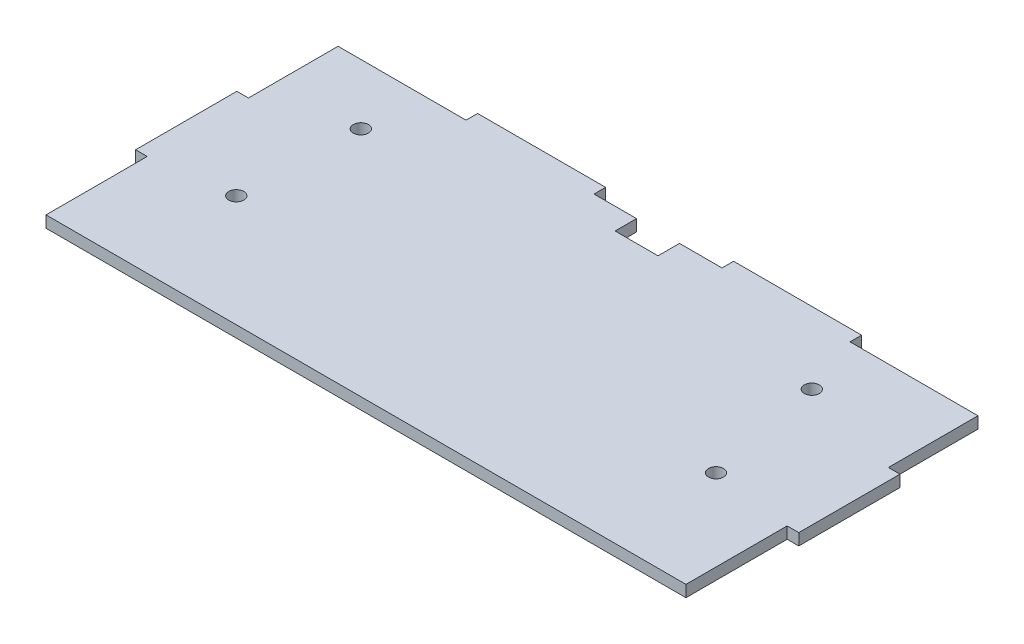
ISO-10303-21;
HEADER;
FILE_DESCRIPTION(('STEP AP214'),'2;1');
FILE_NAME('part.step','',(''),(''),'','','');
FILE_SCHEMA(('AUTOMOTIVE_DESIGN { 1 0 10303 214 1 1 1 1 }'));
ENDSEC;
DATA;
#1=APPLICATION_CONTEXT('core data for automotive mechanical design processes');
#2=APPLICATION_PROTOCOL_DEFINITION('international standard','automotive_design',2000,#1);
#3=PRODUCT_CONTEXT('',#1,'mechanical');
#4=PRODUCT('Part','Part','',(#3));
#5=PRODUCT_RELATED_PRODUCT_CATEGORY('part','',(#4));
#6=PRODUCT_DEFINITION_FORMATION('','',#4);
#7=PRODUCT_DEFINITION_CONTEXT('part definition',#1,'design');
#8=PRODUCT_DEFINITION('design','',#6,#7);
#9=PRODUCT_DEFINITION_SHAPE('','',#8);
#10=(LENGTH_UNIT() NAMED_UNIT(*) SI_UNIT(.MILLI.,.METRE.));
#11=(NAMED_UNIT(*) PLANE_ANGLE_UNIT() SI_UNIT($,.RADIAN.));
#12=(NAMED_UNIT(*) SI_UNIT($,.STERADIAN.) SOLID_ANGLE_UNIT());
#13=UNCERTAINTY_MEASURE_WITH_UNIT(LENGTH_MEASURE(1.E-05),#10,'distance_accuracy_value','');
#14=(GEOMETRIC_REPRESENTATION_CONTEXT(3) GLOBAL_UNCERTAINTY_ASSIGNED_CONTEXT((#13)) GLOBAL_UNIT_ASSIGNED_CONTEXT((#10,
#11,#12)) REPRESENTATION_CONTEXT('',''));
#15=CARTESIAN_POINT('',(0.,0.,0.));
#16=DIRECTION('',(0.,0.,1.));
#17=DIRECTION('',(1.,0.,0.));
#18=AXIS2_PLACEMENT_3D('',#15,#16,#17);
#19=CARTESIAN_POINT('',(0.,2.7,0.));
#20=DIRECTION('',(0.,-1.,0.));
#21=DIRECTION('',(0.,0.,-1.));
#22=AXIS2_PLACEMENT_3D('',#19,#20,#21);
#23=PLANE('',#22);
#24=DIRECTION('',(1.,0.,0.));
#25=VECTOR('',#24,1.);
#26=CARTESIAN_POINT('',(-7.69999999999999,2.7,-18.5666666666667));
#27=LINE('',#26,#25);
#28=CARTESIAN_POINT('',(-7.69999999999999,2.7,-18.5666666666667));
#29=VERTEX_POINT('',#28);
#30=CARTESIAN_POINT('',(-5.,2.7,-18.5666666666667));
#31=VERTEX_POINT('',#30);
#32=EDGE_CURVE('E273',#29,#31,#27,.T.);
#33=ORIENTED_EDGE('',*,*,#32,.T.);
#34=DIRECTION('',(0.,0.,1.));
#35=VECTOR('',#34,1.);
#36=CARTESIAN_POINT('',(-5.,2.7,-18.5666666666667));
#37=LINE('',#36,#35);
#38=CARTESIAN_POINT('',(-5.,2.7,5.));
#39=VERTEX_POINT('',#38);
#40=EDGE_CURVE('E140',#31,#39,#37,.T.);
#41=ORIENTED_EDGE('',*,*,#40,.T.);
#42=DIRECTION('',(1.,0.,0.));
#43=VECTOR('',#42,1.);
#44=CARTESIAN_POINT('',(-5.,2.7,5.));
#45=LINE('',#44,#43);
#46=CARTESIAN_POINT('',(144.,2.7,5.));
#47=VERTEX_POINT('',#46);
#48=EDGE_CURVE('E335',#39,#47,#45,.T.);
#49=ORIENTED_EDGE('',*,*,#48,.T.);
#50=DIRECTION('',(0.,0.,-1.));
#51=VECTOR('',#50,1.);
#52=CARTESIAN_POINT('',(144.,2.7,-18.5666666666667));
#53=LINE('',#52,#51);
#54=CARTESIAN_POINT('',(144.,2.7,-18.5666666666667));
#55=VERTEX_POINT('',#54);
#56=EDGE_CURVE('E356',#47,#55,#53,.T.);
#57=ORIENTED_EDGE('',*,*,#56,.T.);
#58=DIRECTION('',(1.,0.,0.));
#59=VECTOR('',#58,1.);
#60=CARTESIAN_POINT('',(146.7,2.7,-18.5666666666667));
#61=LINE('',#60,#59);
#62=CARTESIAN_POINT('',(146.7,2.7,-18.5666666666667));
#63=VERTEX_POINT('',#62);
#64=EDGE_CURVE('E353',#55,#63,#61,.T.);
#65=ORIENTED_EDGE('',*,*,#64,.T.);
#66=DIRECTION('',(0.,0.,-1.));
#67=VECTOR('',#66,1.);
#68=CARTESIAN_POINT('',(146.7,2.7,-18.5666666666667));
#69=LINE('',#68,#67);
#70=CARTESIAN_POINT('',(146.7,2.7,-42.1333333333333));
#71=VERTEX_POINT('',#70);
#72=EDGE_CURVE('E355',#63,#71,#69,.T.);
#73=ORIENTED_EDGE('',*,*,#72,.T.);
#74=DIRECTION('',(-1.,0.,0.));
#75=VECTOR('',#74,1.);
#76=CARTESIAN_POINT('',(146.7,2.7,-42.1333333333333));
#77=LINE('',#76,#75);
#78=CARTESIAN_POINT('',(144.,2.7,-42.1333333333333));
#79=VERTEX_POINT('',#78);
#80=EDGE_CURVE('E358',#71,#79,#77,.T.);
#81=ORIENTED_EDGE('',*,*,#80,.T.);
#82=DIRECTION('',(0.,0.,-1.));
#83=VECTOR('',#82,1.);
#84=CARTESIAN_POINT('',(144.,2.7,-63.));
#85=LINE('',#84,#83);
#86=CARTESIAN_POINT('',(144.,2.7,-63.));
#87=VERTEX_POINT('',#86);
#88=EDGE_CURVE('E364',#79,#87,#85,.T.);
#89=ORIENTED_EDGE('',*,*,#88,.T.);
#90=DIRECTION('',(-1.,0.,0.));
#91=VECTOR('',#90,1.);
#92=CARTESIAN_POINT('',(114.2,2.7,-63.));
#93=LINE('',#92,#91);
#94=CARTESIAN_POINT('',(114.2,2.7,-63.));
#95=VERTEX_POINT('',#94);
#96=EDGE_CURVE('E366',#87,#95,#93,.T.);
#97=ORIENTED_EDGE('',*,*,#96,.T.);
#98=DIRECTION('',(0.,0.,-1.));
#99=VECTOR('',#98,1.);
#100=CARTESIAN_POINT('',(114.2,2.7,-65.7));
#101=LINE('',#100,#99);
#102=CARTESIAN_POINT('',(114.2,2.7,-65.7));
#103=VERTEX_POINT('',#102);
#104=EDGE_CURVE('E368',#95,#103,#101,.T.);
#105=ORIENTED_EDGE('',*,*,#104,.T.);
#106=DIRECTION('',(-1.,0.,0.));
#107=VECTOR('',#106,1.);
#108=CARTESIAN_POINT('',(84.4,2.7,-65.7));
#109=LINE('',#108,#107);
#110=CARTESIAN_POINT('',(84.4,2.7,-65.7));
#111=VERTEX_POINT('',#110);
#112=EDGE_CURVE('E370',#103,#111,#109,.T.);
#113=ORIENTED_EDGE('',*,*,#112,.T.);
#114=DIRECTION('',(0.,0.,1.));
#115=VECTOR('',#114,1.);
#116=CARTESIAN_POINT('',(84.4,2.7,-65.7));
#117=LINE('',#116,#115);
#118=CARTESIAN_POINT('',(84.4,2.7,-63.));
#119=VERTEX_POINT('',#118);
#120=EDGE_CURVE('E372',#111,#119,#117,.T.);
#121=ORIENTED_EDGE('',*,*,#120,.T.);
#122=DIRECTION('',(-1.,0.,0.));
#123=VECTOR('',#122,1.);
#124=CARTESIAN_POINT('',(74.5,2.7,-63.));
#125=LINE('',#124,#123);
#126=CARTESIAN_POINT('',(74.5,2.7,-63.));
#127=VERTEX_POINT('',#126);
#128=EDGE_CURVE('E374',#119,#127,#125,.T.);
#129=ORIENTED_EDGE('',*,*,#128,.T.);
#130=DIRECTION('',(0.,0.,1.));
#131=VECTOR('',#130,1.);
#132=CARTESIAN_POINT('',(74.5,2.7,-63.));
#133=LINE('',#132,#131);
#134=CARTESIAN_POINT('',(74.5,2.7,-58.));
#135=VERTEX_POINT('',#134);
#136=EDGE_CURVE('E376',#127,#135,#133,.T.);
#137=ORIENTED_EDGE('',*,*,#136,.T.);
#138=DIRECTION('',(-1.,0.,0.));
#139=VECTOR('',#138,1.);
#140=CARTESIAN_POINT('',(74.5,2.7,-58.));
#141=LINE('',#140,#139);
#142=CARTESIAN_POINT('',(64.5,2.7,-58.));
#143=VERTEX_POINT('',#142);
#144=EDGE_CURVE('E378',#135,#143,#141,.T.);
#145=ORIENTED_EDGE('',*,*,#144,.T.);
#146=DIRECTION('',(0.,0.,-1.));
#147=VECTOR('',#146,1.);
#148=CARTESIAN_POINT('',(64.5,2.7,-63.));
#149=LINE('',#148,#147);
#150=CARTESIAN_POINT('',(64.5,2.7,-63.));
#151=VERTEX_POINT('',#150);
#152=EDGE_CURVE('E380',#143,#151,#149,.T.);
#153=ORIENTED_EDGE('',*,*,#152,.T.);
#154=DIRECTION('',(-1.,0.,0.));
#155=VECTOR('',#154,1.);
#156=CARTESIAN_POINT('',(54.6,2.7,-63.));
#157=LINE('',#156,#155);
#158=CARTESIAN_POINT('',(54.6,2.7,-63.));
#159=VERTEX_POINT('',#158);
#160=EDGE_CURVE('E382',#151,#159,#157,.T.);
#161=ORIENTED_EDGE('',*,*,#160,.T.);
#162=DIRECTION('',(0.,0.,-1.));
#163=VECTOR('',#162,1.);
#164=CARTESIAN_POINT('',(54.6,2.7,-65.7));
#165=LINE('',#164,#163);
#166=CARTESIAN_POINT('',(54.6,2.7,-65.7));
#167=VERTEX_POINT('',#166);
#168=EDGE_CURVE('E384',#159,#167,#165,.T.);
#169=ORIENTED_EDGE('',*,*,#168,.T.);
#170=DIRECTION('',(-1.,0.,0.));
#171=VECTOR('',#170,1.);
#172=CARTESIAN_POINT('',(24.8,2.7,-65.7));
#173=LINE('',#172,#171);
#174=CARTESIAN_POINT('',(24.8,2.7,-65.7));
#175=VERTEX_POINT('',#174);
#176=EDGE_CURVE('E386',#167,#175,#173,.T.);
#177=ORIENTED_EDGE('',*,*,#176,.T.);
#178=DIRECTION('',(0.,0.,1.));
#179=VECTOR('',#178,1.);
#180=CARTESIAN_POINT('',(24.8,2.7,-65.7));
#181=LINE('',#180,#179);
#182=CARTESIAN_POINT('',(24.8,2.7,-63.));
#183=VERTEX_POINT('',#182);
#184=EDGE_CURVE('E388',#175,#183,#181,.T.);
#185=ORIENTED_EDGE('',*,*,#184,.T.);
#186=DIRECTION('',(-1.,0.,0.));
#187=VECTOR('',#186,1.);
#188=CARTESIAN_POINT('',(-5.,2.7,-63.));
#189=LINE('',#188,#187);
#190=CARTESIAN_POINT('',(-5.,2.7,-63.));
#191=VERTEX_POINT('',#190);
#192=EDGE_CURVE('E207',#183,#191,#189,.T.);
#193=ORIENTED_EDGE('',*,*,#192,.T.);
#194=DIRECTION('',(0.,0.,1.));
#195=VECTOR('',#194,1.);
#196=CARTESIAN_POINT('',(-5.,2.7,-63.));
#197=LINE('',#196,#195);
#198=CARTESIAN_POINT('',(-5.,2.7,-42.1333333333333));
#199=VERTEX_POINT('',#198);
#200=EDGE_CURVE('E201',#191,#199,#197,.T.);
#201=ORIENTED_EDGE('',*,*,#200,.T.);
#202=DIRECTION('',(-1.,0.,0.));
#203=VECTOR('',#202,1.);
#204=CARTESIAN_POINT('',(-7.69999999999999,2.7,-42.1333333333333));
#205=LINE('',#204,#203);
#206=CARTESIAN_POINT('',(-7.69999999999999,2.7,-42.1333333333333));
#207=VERTEX_POINT('',#206);
#208=EDGE_CURVE('E205',#199,#207,#205,.T.);
#209=ORIENTED_EDGE('',*,*,#208,.T.);
#210=DIRECTION('',(0.,0.,1.));
#211=VECTOR('',#210,1.);
#212=CARTESIAN_POINT('',(-7.69999999999999,2.7,-18.5666666666667));
#213=LINE('',#212,#211);
#214=EDGE_CURVE('E49',#207,#29,#213,.T.);
#215=ORIENTED_EDGE('',*,*,#214,.T.);
#216=EDGE_LOOP('',(#33,#41,#49,#57,#65,#73,#81,#89,#97,#105,#113,#121,#129,#137,#145,#153,#161,
#169,#177,#185,#193,#201,#209,#215));
#217=FACE_BOUND('',#216,.T.);
#218=CARTESIAN_POINT('',(13.3,2.7,-21.));
#219=DIRECTION('',(0.,1.,0.));
#220=DIRECTION('',(0.,0.,1.));
#221=AXIS2_PLACEMENT_3D('',#218,#219,#220);
#222=CIRCLE('',#221,1.75);
#223=CARTESIAN_POINT('',(13.3,2.7,-19.25));
#224=VERTEX_POINT('',#223);
#225=EDGE_CURVE('E229',#224,#224,#222,.T.);
#226=ORIENTED_EDGE('',*,*,#225,.F.);
#227=EDGE_LOOP('',(#226));
#228=FACE_BOUND('',#227,.T.);
#229=CARTESIAN_POINT('',(14.3,2.7,-49.));
#230=DIRECTION('',(0.,1.,0.));
#231=DIRECTION('',(0.,0.,1.));
#232=AXIS2_PLACEMENT_3D('',#229,#230,#231);
#233=CIRCLE('',#232,1.75);
#234=CARTESIAN_POINT('',(14.3,2.7,-47.25));
#235=VERTEX_POINT('',#234);
#236=EDGE_CURVE('E724',#235,#235,#233,.T.);
#237=ORIENTED_EDGE('',*,*,#236,.F.);
#238=EDGE_LOOP('',(#237));
#239=FACE_BOUND('',#238,.T.);
#240=CARTESIAN_POINT('',(119.3,2.7,-49.));
#241=DIRECTION('',(0.,1.,0.));
#242=DIRECTION('',(0.,0.,1.));
#243=AXIS2_PLACEMENT_3D('',#240,#241,#242);
#244=CIRCLE('',#243,1.75);
#245=CARTESIAN_POINT('',(119.3,2.7,-47.25));
#246=VERTEX_POINT('',#245);
#247=EDGE_CURVE('E730',#246,#246,#244,.T.);
#248=ORIENTED_EDGE('',*,*,#247,.F.);
#249=EDGE_LOOP('',(#248));
#250=FACE_BOUND('',#249,.T.);
#251=CARTESIAN_POINT('',(125.,2.7,-21.));
#252=DIRECTION('',(0.,1.,0.));
#253=DIRECTION('',(0.,0.,1.));
#254=AXIS2_PLACEMENT_3D('',#251,#252,#253);
#255=CIRCLE('',#254,1.75000000000001);
#256=CARTESIAN_POINT('',(125.,2.7,-19.25));
#257=VERTEX_POINT('',#256);
#258=EDGE_CURVE('E736',#257,#257,#255,.T.);
#259=ORIENTED_EDGE('',*,*,#258,.F.);
#260=EDGE_LOOP('',(#259));
#261=FACE_BOUND('',#260,.T.);
#262=ADVANCED_FACE('F32',(#217,#228,#239,#250,#261),#23,.F.);
#263=CARTESIAN_POINT('',(0.,0.,0.));
#264=DIRECTION('',(0.,-1.,0.));
#265=DIRECTION('',(0.,0.,-1.));
#266=AXIS2_PLACEMENT_3D('',#263,#264,#265);
#267=PLANE('',#266);
#268=CARTESIAN_POINT('',(119.3,0.,-49.));
#269=DIRECTION('',(0.,1.,0.));
#270=DIRECTION('',(0.,0.,1.));
#271=AXIS2_PLACEMENT_3D('',#268,#269,#270);
#272=CIRCLE('',#271,1.75);
#273=CARTESIAN_POINT('',(119.3,0.,-47.25));
#274=VERTEX_POINT('',#273);
#275=EDGE_CURVE('E733',#274,#274,#272,.T.);
#276=ORIENTED_EDGE('',*,*,#275,.T.);
#277=EDGE_LOOP('',(#276));
#278=FACE_BOUND('',#277,.T.);
#279=CARTESIAN_POINT('',(13.3,0.,-21.));
#280=DIRECTION('',(0.,1.,0.));
#281=DIRECTION('',(0.,0.,1.));
#282=AXIS2_PLACEMENT_3D('',#279,#280,#281);
#283=CIRCLE('',#282,1.75);
#284=CARTESIAN_POINT('',(13.3,0.,-19.25));
#285=VERTEX_POINT('',#284);
#286=EDGE_CURVE('E721',#285,#285,#283,.T.);
#287=ORIENTED_EDGE('',*,*,#286,.T.);
#288=EDGE_LOOP('',(#287));
#289=FACE_BOUND('',#288,.T.);
#290=DIRECTION('',(1.,0.,0.));
#291=VECTOR('',#290,1.);
#292=CARTESIAN_POINT('',(-7.69999999999999,0.,-18.5666666666667));
#293=LINE('',#292,#291);
#294=CARTESIAN_POINT('',(-7.69999999999999,0.,-18.5666666666667));
#295=VERTEX_POINT('',#294);
#296=CARTESIAN_POINT('',(-5.,0.,-18.5666666666667));
#297=VERTEX_POINT('',#296);
#298=EDGE_CURVE('E225',#295,#297,#293,.T.);
#299=ORIENTED_EDGE('',*,*,#298,.F.);
#300=DIRECTION('',(0.,0.,1.));
#301=VECTOR('',#300,1.);
#302=CARTESIAN_POINT('',(-7.69999999999999,0.,-18.5666666666667));
#303=LINE('',#302,#301);
#304=CARTESIAN_POINT('',(-7.69999999999999,0.,-42.1333333333333));
#305=VERTEX_POINT('',#304);
#306=EDGE_CURVE('E132',#305,#295,#303,.T.);
#307=ORIENTED_EDGE('',*,*,#306,.F.);
#308=DIRECTION('',(-1.,0.,0.));
#309=VECTOR('',#308,1.);
#310=CARTESIAN_POINT('',(-7.69999999999999,0.,-42.1333333333333));
#311=LINE('',#310,#309);
#312=CARTESIAN_POINT('',(-5.,0.,-42.1333333333333));
#313=VERTEX_POINT('',#312);
#314=EDGE_CURVE('E126',#313,#305,#311,.T.);
#315=ORIENTED_EDGE('',*,*,#314,.F.);
#316=DIRECTION('',(0.,0.,1.));
#317=VECTOR('',#316,1.);
#318=CARTESIAN_POINT('',(-5.,0.,-63.));
#319=LINE('',#318,#317);
#320=CARTESIAN_POINT('',(-5.,0.,-63.));
#321=VERTEX_POINT('',#320);
#322=EDGE_CURVE('E215',#321,#313,#319,.T.);
#323=ORIENTED_EDGE('',*,*,#322,.F.);
#324=DIRECTION('',(-1.,0.,0.));
#325=VECTOR('',#324,1.);
#326=CARTESIAN_POINT('',(-5.,0.,-63.));
#327=LINE('',#326,#325);
#328=CARTESIAN_POINT('',(24.8,0.,-63.));
#329=VERTEX_POINT('',#328);
#330=EDGE_CURVE('E268',#329,#321,#327,.T.);
#331=ORIENTED_EDGE('',*,*,#330,.F.);
#332=DIRECTION('',(0.,0.,1.));
#333=VECTOR('',#332,1.);
#334=CARTESIAN_POINT('',(24.8,0.,-65.7));
#335=LINE('',#334,#333);
#336=CARTESIAN_POINT('',(24.8,0.,-65.7));
#337=VERTEX_POINT('',#336);
#338=EDGE_CURVE('E266',#337,#329,#335,.T.);
#339=ORIENTED_EDGE('',*,*,#338,.F.);
#340=DIRECTION('',(-1.,0.,0.));
#341=VECTOR('',#340,1.);
#342=CARTESIAN_POINT('',(24.8,0.,-65.7));
#343=LINE('',#342,#341);
#344=CARTESIAN_POINT('',(54.6,0.,-65.7));
#345=VERTEX_POINT('',#344);
#346=EDGE_CURVE('E264',#345,#337,#343,.T.);
#347=ORIENTED_EDGE('',*,*,#346,.F.);
#348=DIRECTION('',(0.,0.,-1.));
#349=VECTOR('',#348,1.);
#350=CARTESIAN_POINT('',(54.6,0.,-65.7));
#351=LINE('',#350,#349);
#352=CARTESIAN_POINT('',(54.6,0.,-63.));
#353=VERTEX_POINT('',#352);
#354=EDGE_CURVE('E262',#353,#345,#351,.T.);
#355=ORIENTED_EDGE('',*,*,#354,.F.);
#356=DIRECTION('',(-1.,0.,0.));
#357=VECTOR('',#356,1.);
#358=CARTESIAN_POINT('',(54.6,0.,-63.));
#359=LINE('',#358,#357);
#360=CARTESIAN_POINT('',(64.5,0.,-63.));
#361=VERTEX_POINT('',#360);
#362=EDGE_CURVE('E260',#361,#353,#359,.T.);
#363=ORIENTED_EDGE('',*,*,#362,.F.);
#364=DIRECTION('',(0.,0.,-1.));
#365=VECTOR('',#364,1.);
#366=CARTESIAN_POINT('',(64.5,0.,-63.));
#367=LINE('',#366,#365);
#368=CARTESIAN_POINT('',(64.5,0.,-58.));
#369=VERTEX_POINT('',#368);
#370=EDGE_CURVE('E258',#369,#361,#367,.T.);
#371=ORIENTED_EDGE('',*,*,#370,.F.);
#372=DIRECTION('',(-1.,0.,0.));
#373=VECTOR('',#372,1.);
#374=CARTESIAN_POINT('',(74.5,0.,-58.));
#375=LINE('',#374,#373);
#376=CARTESIAN_POINT('',(74.5,0.,-58.));
#377=VERTEX_POINT('',#376);
#378=EDGE_CURVE('E256',#377,#369,#375,.T.);
#379=ORIENTED_EDGE('',*,*,#378,.F.);
#380=DIRECTION('',(0.,0.,1.));
#381=VECTOR('',#380,1.);
#382=CARTESIAN_POINT('',(74.5,0.,-63.));
#383=LINE('',#382,#381);
#384=CARTESIAN_POINT('',(74.5,0.,-63.));
#385=VERTEX_POINT('',#384);
#386=EDGE_CURVE('E254',#385,#377,#383,.T.);
#387=ORIENTED_EDGE('',*,*,#386,.F.);
#388=DIRECTION('',(-1.,0.,0.));
#389=VECTOR('',#388,1.);
#390=CARTESIAN_POINT('',(74.5,0.,-63.));
#391=LINE('',#390,#389);
#392=CARTESIAN_POINT('',(84.4,0.,-63.));
#393=VERTEX_POINT('',#392);
#394=EDGE_CURVE('E252',#393,#385,#391,.T.);
#395=ORIENTED_EDGE('',*,*,#394,.F.);
#396=DIRECTION('',(0.,0.,1.));
#397=VECTOR('',#396,1.);
#398=CARTESIAN_POINT('',(84.4,0.,-65.7));
#399=LINE('',#398,#397);
#400=CARTESIAN_POINT('',(84.4,0.,-65.7));
#401=VERTEX_POINT('',#400);
#402=EDGE_CURVE('E250',#401,#393,#399,.T.);
#403=ORIENTED_EDGE('',*,*,#402,.F.);
#404=DIRECTION('',(-1.,0.,0.));
#405=VECTOR('',#404,1.);
#406=CARTESIAN_POINT('',(84.4,0.,-65.7));
#407=LINE('',#406,#405);
#408=CARTESIAN_POINT('',(114.2,0.,-65.7));
#409=VERTEX_POINT('',#408);
#410=EDGE_CURVE('E248',#409,#401,#407,.T.);
#411=ORIENTED_EDGE('',*,*,#410,.F.);
#412=DIRECTION('',(0.,0.,-1.));
#413=VECTOR('',#412,1.);
#414=CARTESIAN_POINT('',(114.2,0.,-65.7));
#415=LINE('',#414,#413);
#416=CARTESIAN_POINT('',(114.2,0.,-63.));
#417=VERTEX_POINT('',#416);
#418=EDGE_CURVE('E246',#417,#409,#415,.T.);
#419=ORIENTED_EDGE('',*,*,#418,.F.);
#420=DIRECTION('',(-1.,0.,0.));
#421=VECTOR('',#420,1.);
#422=CARTESIAN_POINT('',(114.2,0.,-63.));
#423=LINE('',#422,#421);
#424=CARTESIAN_POINT('',(144.,0.,-63.));
#425=VERTEX_POINT('',#424);
#426=EDGE_CURVE('E244',#425,#417,#423,.T.);
#427=ORIENTED_EDGE('',*,*,#426,.F.);
#428=DIRECTION('',(0.,0.,-1.));
#429=VECTOR('',#428,1.);
#430=CARTESIAN_POINT('',(144.,0.,-63.));
#431=LINE('',#430,#429);
#432=CARTESIAN_POINT('',(144.,0.,-42.1333333333333));
#433=VERTEX_POINT('',#432);
#434=EDGE_CURVE('E242',#433,#425,#431,.T.);
#435=ORIENTED_EDGE('',*,*,#434,.F.);
#436=DIRECTION('',(-1.,0.,0.));
#437=VECTOR('',#436,1.);
#438=CARTESIAN_POINT('',(146.7,0.,-42.1333333333333));
#439=LINE('',#438,#437);
#440=CARTESIAN_POINT('',(146.7,0.,-42.1333333333333));
#441=VERTEX_POINT('',#440);
#442=EDGE_CURVE('E240',#441,#433,#439,.T.);
#443=ORIENTED_EDGE('',*,*,#442,.F.);
#444=DIRECTION('',(0.,0.,-1.));
#445=VECTOR('',#444,1.);
#446=CARTESIAN_POINT('',(146.7,0.,-18.5666666666667));
#447=LINE('',#446,#445);
#448=CARTESIAN_POINT('',(146.7,0.,-18.5666666666667));
#449=VERTEX_POINT('',#448);
#450=EDGE_CURVE('E238',#449,#441,#447,.T.);
#451=ORIENTED_EDGE('',*,*,#450,.F.);
#452=DIRECTION('',(1.,0.,0.));
#453=VECTOR('',#452,1.);
#454=CARTESIAN_POINT('',(146.7,0.,-18.5666666666667));
#455=LINE('',#454,#453);
#456=CARTESIAN_POINT('',(144.,0.,-18.5666666666667));
#457=VERTEX_POINT('',#456);
#458=EDGE_CURVE('E236',#457,#449,#455,.T.);
#459=ORIENTED_EDGE('',*,*,#458,.F.);
#460=DIRECTION('',(0.,0.,-1.));
#461=VECTOR('',#460,1.);
#462=CARTESIAN_POINT('',(144.,0.,-18.5666666666667));
#463=LINE('',#462,#461);
#464=CARTESIAN_POINT('',(144.,0.,5.));
#465=VERTEX_POINT('',#464);
#466=EDGE_CURVE('E234',#465,#457,#463,.T.);
#467=ORIENTED_EDGE('',*,*,#466,.F.);
#468=DIRECTION('',(1.,0.,0.));
#469=VECTOR('',#468,1.);
#470=CARTESIAN_POINT('',(115.82,0.,5.));
#471=LINE('',#470,#469);
#472=CARTESIAN_POINT('',(-5.,0.,5.));
#473=VERTEX_POINT('',#472);
#474=EDGE_CURVE('E232',#473,#465,#471,.T.);
#475=ORIENTED_EDGE('',*,*,#474,.F.);
#476=DIRECTION('',(0.,0.,1.));
#477=VECTOR('',#476,1.);
#478=CARTESIAN_POINT('',(-5.,0.,-18.5666666666667));
#479=LINE('',#478,#477);
#480=EDGE_CURVE('E228',#297,#473,#479,.T.);
#481=ORIENTED_EDGE('',*,*,#480,.F.);
#482=EDGE_LOOP('',(#299,#307,#315,#323,#331,#339,#347,#355,#363,#371,#379,#387,#395,#403,#411,
#419,#427,#435,#443,#451,#459,#467,#475,#481));
#483=FACE_BOUND('',#482,.T.);
#484=CARTESIAN_POINT('',(14.3,0.,-49.));
#485=DIRECTION('',(0.,1.,0.));
#486=DIRECTION('',(0.,0.,1.));
#487=AXIS2_PLACEMENT_3D('',#484,#485,#486);
#488=CIRCLE('',#487,1.75);
#489=CARTESIAN_POINT('',(14.3,0.,-47.25));
#490=VERTEX_POINT('',#489);
#491=EDGE_CURVE('E727',#490,#490,#488,.T.);
#492=ORIENTED_EDGE('',*,*,#491,.T.);
#493=EDGE_LOOP('',(#492));
#494=FACE_BOUND('',#493,.T.);
#495=CARTESIAN_POINT('',(125.,0.,-21.));
#496=DIRECTION('',(0.,1.,0.));
#497=DIRECTION('',(0.,0.,1.));
#498=AXIS2_PLACEMENT_3D('',#495,#496,#497);
#499=CIRCLE('',#498,1.75000000000001);
#500=CARTESIAN_POINT('',(125.,0.,-19.25));
#501=VERTEX_POINT('',#500);
#502=EDGE_CURVE('E739',#501,#501,#499,.T.);
#503=ORIENTED_EDGE('',*,*,#502,.T.);
#504=EDGE_LOOP('',(#503));
#505=FACE_BOUND('',#504,.T.);
#506=ADVANCED_FACE('F340',(#278,#289,#483,#494,#505),#267,.T.);
#507=CARTESIAN_POINT('',(-7.69999999999999,2.7,-18.5666666666667));
#508=DIRECTION('',(0.,0.,-1.));
#509=DIRECTION('',(-1.,0.,0.));
#510=AXIS2_PLACEMENT_3D('',#507,#508,#509);
#511=PLANE('',#510);
#512=ORIENTED_EDGE('',*,*,#298,.T.);
#513=DIRECTION('',(0.,-1.,0.));
#514=VECTOR('',#513,1.);
#515=CARTESIAN_POINT('',(-5.,2.7,-18.5666666666667));
#516=LINE('',#515,#514);
#517=EDGE_CURVE('E11',#31,#297,#516,.T.);
#518=ORIENTED_EDGE('',*,*,#517,.F.);
#519=ORIENTED_EDGE('',*,*,#32,.F.);
#520=DIRECTION('',(0.,-1.,0.));
#521=VECTOR('',#520,1.);
#522=CARTESIAN_POINT('',(-7.69999999999999,2.7,-18.5666666666667));
#523=LINE('',#522,#521);
#524=EDGE_CURVE('E221',#29,#295,#523,.T.);
#525=ORIENTED_EDGE('',*,*,#524,.T.);
#526=EDGE_LOOP('',(#512,#518,#519,#525));
#527=FACE_BOUND('',#526,.T.);
#528=ADVANCED_FACE('F34',(#527),#511,.F.);
#529=CARTESIAN_POINT('',(-5.,2.7,-18.5666666666667));
#530=DIRECTION('',(1.,0.,0.));
#531=DIRECTION('',(0.,0.,-1.));
#532=AXIS2_PLACEMENT_3D('',#529,#530,#531);
#533=PLANE('',#532);
#534=ORIENTED_EDGE('',*,*,#480,.T.);
#535=DIRECTION('',(0.,-1.,0.));
#536=VECTOR('',#535,1.);
#537=CARTESIAN_POINT('',(-5.,2.7,5.));
#538=LINE('',#537,#536);
#539=EDGE_CURVE('E41',#39,#473,#538,.T.);
#540=ORIENTED_EDGE('',*,*,#539,.F.);
#541=ORIENTED_EDGE('',*,*,#40,.F.);
#542=ORIENTED_EDGE('',*,*,#517,.T.);
#543=EDGE_LOOP('',(#534,#540,#541,#542));
#544=FACE_BOUND('',#543,.T.);
#545=ADVANCED_FACE('F336',(#544),#533,.F.);
#546=CARTESIAN_POINT('',(115.82,2.7,5.));
#547=DIRECTION('',(0.,0.,-1.));
#548=DIRECTION('',(-1.,0.,0.));
#549=AXIS2_PLACEMENT_3D('',#546,#547,#548);
#550=PLANE('',#549);
#551=ORIENTED_EDGE('',*,*,#474,.T.);
#552=DIRECTION('',(0.,-1.,0.));
#553=VECTOR('',#552,1.);
#554=CARTESIAN_POINT('',(144.,2.7,5.));
#555=LINE('',#554,#553);
#556=EDGE_CURVE('E328',#47,#465,#555,.T.);
#557=ORIENTED_EDGE('',*,*,#556,.F.);
#558=ORIENTED_EDGE('',*,*,#48,.F.);
#559=ORIENTED_EDGE('',*,*,#539,.T.);
#560=EDGE_LOOP('',(#551,#557,#558,#559));
#561=FACE_BOUND('',#560,.T.);
#562=ADVANCED_FACE('F333',(#561),#550,.F.);
#563=CARTESIAN_POINT('',(144.,2.7,-18.5666666666667));
#564=DIRECTION('',(-1.,0.,0.));
#565=DIRECTION('',(0.,0.,1.));
#566=AXIS2_PLACEMENT_3D('',#563,#564,#565);
#567=PLANE('',#566);
#568=ORIENTED_EDGE('',*,*,#466,.T.);
#569=DIRECTION('',(0.,-1.,0.));
#570=VECTOR('',#569,1.);
#571=CARTESIAN_POINT('',(144.,2.7,-18.5666666666667));
#572=LINE('',#571,#570);
#573=EDGE_CURVE('E325',#55,#457,#572,.T.);
#574=ORIENTED_EDGE('',*,*,#573,.F.);
#575=ORIENTED_EDGE('',*,*,#56,.F.);
#576=ORIENTED_EDGE('',*,*,#556,.T.);
#577=EDGE_LOOP('',(#568,#574,#575,#576));
#578=FACE_BOUND('',#577,.T.);
#579=ADVANCED_FACE('F347',(#578),#567,.F.);
#580=CARTESIAN_POINT('',(146.7,2.7,-18.5666666666667));
#581=DIRECTION('',(0.,0.,-1.));
#582=DIRECTION('',(-1.,0.,0.));
#583=AXIS2_PLACEMENT_3D('',#580,#581,#582);
#584=PLANE('',#583);
#585=ORIENTED_EDGE('',*,*,#458,.T.);
#586=DIRECTION('',(0.,-1.,0.));
#587=VECTOR('',#586,1.);
#588=CARTESIAN_POINT('',(146.7,2.7,-18.5666666666667));
#589=LINE('',#588,#587);
#590=EDGE_CURVE('E322',#63,#449,#589,.T.);
#591=ORIENTED_EDGE('',*,*,#590,.F.);
#592=ORIENTED_EDGE('',*,*,#64,.F.);
#593=ORIENTED_EDGE('',*,*,#573,.T.);
#594=EDGE_LOOP('',(#585,#591,#592,#593));
#595=FACE_BOUND('',#594,.T.);
#596=ADVANCED_FACE('F351',(#595),#584,.F.);
#597=CARTESIAN_POINT('',(146.7,2.7,-18.5666666666667));
#598=DIRECTION('',(-1.,0.,0.));
#599=DIRECTION('',(0.,0.,1.));
#600=AXIS2_PLACEMENT_3D('',#597,#598,#599);
#601=PLANE('',#600);
#602=ORIENTED_EDGE('',*,*,#450,.T.);
#603=DIRECTION('',(0.,-1.,0.));
#604=VECTOR('',#603,1.);
#605=CARTESIAN_POINT('',(146.7,2.7,-42.1333333333333));
#606=LINE('',#605,#604);
#607=EDGE_CURVE('E319',#71,#441,#606,.T.);
#608=ORIENTED_EDGE('',*,*,#607,.F.);
#609=ORIENTED_EDGE('',*,*,#72,.F.);
#610=ORIENTED_EDGE('',*,*,#590,.T.);
#611=EDGE_LOOP('',(#602,#608,#609,#610));
#612=FACE_BOUND('',#611,.T.);
#613=ADVANCED_FACE('F464',(#612),#601,.F.);
#614=CARTESIAN_POINT('',(146.7,2.7,-42.1333333333333));
#615=DIRECTION('',(0.,0.,1.));
#616=DIRECTION('',(1.,0.,0.));
#617=AXIS2_PLACEMENT_3D('',#614,#615,#616);
#618=PLANE('',#617);
#619=ORIENTED_EDGE('',*,*,#442,.T.);
#620=DIRECTION('',(0.,-1.,0.));
#621=VECTOR('',#620,1.);
#622=CARTESIAN_POINT('',(144.,2.7,-42.1333333333333));
#623=LINE('',#622,#621);
#624=EDGE_CURVE('E316',#79,#433,#623,.T.);
#625=ORIENTED_EDGE('',*,*,#624,.F.);
#626=ORIENTED_EDGE('',*,*,#80,.F.);
#627=ORIENTED_EDGE('',*,*,#607,.T.);
#628=EDGE_LOOP('',(#619,#625,#626,#627));
#629=FACE_BOUND('',#628,.T.);
#630=ADVANCED_FACE('F460',(#629),#618,.F.);
#631=CARTESIAN_POINT('',(144.,2.7,-63.));
#632=DIRECTION('',(-1.,0.,0.));
#633=DIRECTION('',(0.,0.,1.));
#634=AXIS2_PLACEMENT_3D('',#631,#632,#633);
#635=PLANE('',#634);
#636=ORIENTED_EDGE('',*,*,#434,.T.);
#637=DIRECTION('',(0.,-1.,0.));
#638=VECTOR('',#637,1.);
#639=CARTESIAN_POINT('',(144.,2.7,-63.));
#640=LINE('',#639,#638);
#641=EDGE_CURVE('E313',#87,#425,#640,.T.);
#642=ORIENTED_EDGE('',*,*,#641,.F.);
#643=ORIENTED_EDGE('',*,*,#88,.F.);
#644=ORIENTED_EDGE('',*,*,#624,.T.);
#645=EDGE_LOOP('',(#636,#642,#643,#644));
#646=FACE_BOUND('',#645,.T.);
#647=ADVANCED_FACE('F456',(#646),#635,.F.);
#648=CARTESIAN_POINT('',(114.2,2.7,-63.));
#649=DIRECTION('',(0.,0.,1.));
#650=DIRECTION('',(1.,0.,0.));
#651=AXIS2_PLACEMENT_3D('',#648,#649,#650);
#652=PLANE('',#651);
#653=ORIENTED_EDGE('',*,*,#426,.T.);
#654=DIRECTION('',(0.,-1.,0.));
#655=VECTOR('',#654,1.);
#656=CARTESIAN_POINT('',(114.2,2.7,-63.));
#657=LINE('',#656,#655);
#658=EDGE_CURVE('E310',#95,#417,#657,.T.);
#659=ORIENTED_EDGE('',*,*,#658,.F.);
#660=ORIENTED_EDGE('',*,*,#96,.F.);
#661=ORIENTED_EDGE('',*,*,#641,.T.);
#662=EDGE_LOOP('',(#653,#659,#660,#661));
#663=FACE_BOUND('',#662,.T.);
#664=ADVANCED_FACE('F452',(#663),#652,.F.);
#665=CARTESIAN_POINT('',(114.2,2.7,-65.7));
#666=DIRECTION('',(-1.,0.,0.));
#667=DIRECTION('',(0.,0.,1.));
#668=AXIS2_PLACEMENT_3D('',#665,#666,#667);
#669=PLANE('',#668);
#670=ORIENTED_EDGE('',*,*,#418,.T.);
#671=DIRECTION('',(0.,-1.,0.));
#672=VECTOR('',#671,1.);
#673=CARTESIAN_POINT('',(114.2,2.7,-65.7));
#674=LINE('',#673,#672);
#675=EDGE_CURVE('E307',#103,#409,#674,.T.);
#676=ORIENTED_EDGE('',*,*,#675,.F.);
#677=ORIENTED_EDGE('',*,*,#104,.F.);
#678=ORIENTED_EDGE('',*,*,#658,.T.);
#679=EDGE_LOOP('',(#670,#676,#677,#678));
#680=FACE_BOUND('',#679,.T.);
#681=ADVANCED_FACE('F447',(#680),#669,.F.);
#682=CARTESIAN_POINT('',(84.4,2.7,-65.7));
#683=DIRECTION('',(0.,0.,1.));
#684=DIRECTION('',(1.,0.,0.));
#685=AXIS2_PLACEMENT_3D('',#682,#683,#684);
#686=PLANE('',#685);
#687=ORIENTED_EDGE('',*,*,#410,.T.);
#688=DIRECTION('',(0.,-1.,0.));
#689=VECTOR('',#688,1.);
#690=CARTESIAN_POINT('',(84.4,2.7,-65.7));
#691=LINE('',#690,#689);
#692=EDGE_CURVE('E304',#111,#401,#691,.T.);
#693=ORIENTED_EDGE('',*,*,#692,.F.);
#694=ORIENTED_EDGE('',*,*,#112,.F.);
#695=ORIENTED_EDGE('',*,*,#675,.T.);
#696=EDGE_LOOP('',(#687,#693,#694,#695));
#697=FACE_BOUND('',#696,.T.);
#698=ADVANCED_FACE('F441',(#697),#686,.F.);
#699=CARTESIAN_POINT('',(84.4,2.7,-65.7));
#700=DIRECTION('',(1.,0.,0.));
#701=DIRECTION('',(0.,0.,-1.));
#702=AXIS2_PLACEMENT_3D('',#699,#700,#701);
#703=PLANE('',#702);
#704=ORIENTED_EDGE('',*,*,#402,.T.);
#705=DIRECTION('',(0.,-1.,0.));
#706=VECTOR('',#705,1.);
#707=CARTESIAN_POINT('',(84.4,2.7,-63.));
#708=LINE('',#707,#706);
#709=EDGE_CURVE('E301',#119,#393,#708,.T.);
#710=ORIENTED_EDGE('',*,*,#709,.F.);
#711=ORIENTED_EDGE('',*,*,#120,.F.);
#712=ORIENTED_EDGE('',*,*,#692,.T.);
#713=EDGE_LOOP('',(#704,#710,#711,#712));
#714=FACE_BOUND('',#713,.T.);
#715=ADVANCED_FACE('F437',(#714),#703,.F.);
#716=CARTESIAN_POINT('',(74.5,2.7,-63.));
#717=DIRECTION('',(0.,0.,1.));
#718=DIRECTION('',(1.,0.,0.));
#719=AXIS2_PLACEMENT_3D('',#716,#717,#718);
#720=PLANE('',#719);
#721=ORIENTED_EDGE('',*,*,#394,.T.);
#722=DIRECTION('',(0.,-1.,0.));
#723=VECTOR('',#722,1.);
#724=CARTESIAN_POINT('',(74.5,2.7,-63.));
#725=LINE('',#724,#723);
#726=EDGE_CURVE('E298',#127,#385,#725,.T.);
#727=ORIENTED_EDGE('',*,*,#726,.F.);
#728=ORIENTED_EDGE('',*,*,#128,.F.);
#729=ORIENTED_EDGE('',*,*,#709,.T.);
#730=EDGE_LOOP('',(#721,#727,#728,#729));
#731=FACE_BOUND('',#730,.T.);
#732=ADVANCED_FACE('F432',(#731),#720,.F.);
#733=CARTESIAN_POINT('',(74.5,2.7,-63.));
#734=DIRECTION('',(1.,0.,0.));
#735=DIRECTION('',(0.,0.,-1.));
#736=AXIS2_PLACEMENT_3D('',#733,#734,#735);
#737=PLANE('',#736);
#738=ORIENTED_EDGE('',*,*,#386,.T.);
#739=DIRECTION('',(0.,-1.,0.));
#740=VECTOR('',#739,1.);
#741=CARTESIAN_POINT('',(74.5,2.7,-58.));
#742=LINE('',#741,#740);
#743=EDGE_CURVE('E295',#135,#377,#742,.T.);
#744=ORIENTED_EDGE('',*,*,#743,.F.);
#745=ORIENTED_EDGE('',*,*,#136,.F.);
#746=ORIENTED_EDGE('',*,*,#726,.T.);
#747=EDGE_LOOP('',(#738,#744,#745,#746));
#748=FACE_BOUND('',#747,.T.);
#749=ADVANCED_FACE('F426',(#748),#737,.F.);
#750=CARTESIAN_POINT('',(74.5,2.7,-58.));
#751=DIRECTION('',(0.,0.,1.));
#752=DIRECTION('',(1.,0.,0.));
#753=AXIS2_PLACEMENT_3D('',#750,#751,#752);
#754=PLANE('',#753);
#755=ORIENTED_EDGE('',*,*,#378,.T.);
#756=DIRECTION('',(0.,-1.,0.));
#757=VECTOR('',#756,1.);
#758=CARTESIAN_POINT('',(64.5,2.7,-58.));
#759=LINE('',#758,#757);
#760=EDGE_CURVE('E292',#143,#369,#759,.T.);
#761=ORIENTED_EDGE('',*,*,#760,.F.);
#762=ORIENTED_EDGE('',*,*,#144,.F.);
#763=ORIENTED_EDGE('',*,*,#743,.T.);
#764=EDGE_LOOP('',(#755,#761,#762,#763));
#765=FACE_BOUND('',#764,.T.);
#766=ADVANCED_FACE('F422',(#765),#754,.F.);
#767=CARTESIAN_POINT('',(64.5,2.7,-63.));
#768=DIRECTION('',(-1.,0.,0.));
#769=DIRECTION('',(0.,0.,1.));
#770=AXIS2_PLACEMENT_3D('',#767,#768,#769);
#771=PLANE('',#770);
#772=ORIENTED_EDGE('',*,*,#370,.T.);
#773=DIRECTION('',(0.,-1.,0.));
#774=VECTOR('',#773,1.);
#775=CARTESIAN_POINT('',(64.5,2.7,-63.));
#776=LINE('',#775,#774);
#777=EDGE_CURVE('E289',#151,#361,#776,.T.);
#778=ORIENTED_EDGE('',*,*,#777,.F.);
#779=ORIENTED_EDGE('',*,*,#152,.F.);
#780=ORIENTED_EDGE('',*,*,#760,.T.);
#781=EDGE_LOOP('',(#772,#778,#779,#780));
#782=FACE_BOUND('',#781,.T.);
#783=ADVANCED_FACE('F417',(#782),#771,.F.);
#784=CARTESIAN_POINT('',(54.6,2.7,-63.));
#785=DIRECTION('',(0.,0.,1.));
#786=DIRECTION('',(1.,0.,0.));
#787=AXIS2_PLACEMENT_3D('',#784,#785,#786);
#788=PLANE('',#787);
#789=ORIENTED_EDGE('',*,*,#362,.T.);
#790=DIRECTION('',(0.,-1.,0.));
#791=VECTOR('',#790,1.);
#792=CARTESIAN_POINT('',(54.6,2.7,-63.));
#793=LINE('',#792,#791);
#794=EDGE_CURVE('E286',#159,#353,#793,.T.);
#795=ORIENTED_EDGE('',*,*,#794,.F.);
#796=ORIENTED_EDGE('',*,*,#160,.F.);
#797=ORIENTED_EDGE('',*,*,#777,.T.);
#798=EDGE_LOOP('',(#789,#795,#796,#797));
#799=FACE_BOUND('',#798,.T.);
#800=ADVANCED_FACE('F411',(#799),#788,.F.);
#801=CARTESIAN_POINT('',(54.6,2.7,-65.7));
#802=DIRECTION('',(-1.,0.,0.));
#803=DIRECTION('',(0.,0.,1.));
#804=AXIS2_PLACEMENT_3D('',#801,#802,#803);
#805=PLANE('',#804);
#806=ORIENTED_EDGE('',*,*,#354,.T.);
#807=DIRECTION('',(0.,-1.,0.));
#808=VECTOR('',#807,1.);
#809=CARTESIAN_POINT('',(54.6,2.7,-65.7));
#810=LINE('',#809,#808);
#811=EDGE_CURVE('E283',#167,#345,#810,.T.);
#812=ORIENTED_EDGE('',*,*,#811,.F.);
#813=ORIENTED_EDGE('',*,*,#168,.F.);
#814=ORIENTED_EDGE('',*,*,#794,.T.);
#815=EDGE_LOOP('',(#806,#812,#813,#814));
#816=FACE_BOUND('',#815,.T.);
#817=ADVANCED_FACE('F407',(#816),#805,.F.);
#818=CARTESIAN_POINT('',(24.8,2.7,-65.7));
#819=DIRECTION('',(0.,0.,1.));
#820=DIRECTION('',(1.,0.,0.));
#821=AXIS2_PLACEMENT_3D('',#818,#819,#820);
#822=PLANE('',#821);
#823=ORIENTED_EDGE('',*,*,#346,.T.);
#824=DIRECTION('',(0.,-1.,0.));
#825=VECTOR('',#824,1.);
#826=CARTESIAN_POINT('',(24.8,2.7,-65.7));
#827=LINE('',#826,#825);
#828=EDGE_CURVE('E280',#175,#337,#827,.T.);
#829=ORIENTED_EDGE('',*,*,#828,.F.);
#830=ORIENTED_EDGE('',*,*,#176,.F.);
#831=ORIENTED_EDGE('',*,*,#811,.T.);
#832=EDGE_LOOP('',(#823,#829,#830,#831));
#833=FACE_BOUND('',#832,.T.);
#834=ADVANCED_FACE('F403',(#833),#822,.F.);
#835=CARTESIAN_POINT('',(24.8,2.7,-65.7));
#836=DIRECTION('',(1.,0.,0.));
#837=DIRECTION('',(0.,0.,-1.));
#838=AXIS2_PLACEMENT_3D('',#835,#836,#837);
#839=PLANE('',#838);
#840=ORIENTED_EDGE('',*,*,#338,.T.);
#841=DIRECTION('',(0.,-1.,0.));
#842=VECTOR('',#841,1.);
#843=CARTESIAN_POINT('',(24.8,2.7,-63.));
#844=LINE('',#843,#842);
#845=EDGE_CURVE('E277',#183,#329,#844,.T.);
#846=ORIENTED_EDGE('',*,*,#845,.F.);
#847=ORIENTED_EDGE('',*,*,#184,.F.);
#848=ORIENTED_EDGE('',*,*,#828,.T.);
#849=EDGE_LOOP('',(#840,#846,#847,#848));
#850=FACE_BOUND('',#849,.T.);
#851=ADVANCED_FACE('F394',(#850),#839,.F.);
#852=CARTESIAN_POINT('',(-5.,2.7,-63.));
#853=DIRECTION('',(0.,0.,1.));
#854=DIRECTION('',(1.,0.,0.));
#855=AXIS2_PLACEMENT_3D('',#852,#853,#854);
#856=PLANE('',#855);
#857=ORIENTED_EDGE('',*,*,#330,.T.);
#858=DIRECTION('',(0.,-1.,0.));
#859=VECTOR('',#858,1.);
#860=CARTESIAN_POINT('',(-5.,2.7,-63.));
#861=LINE('',#860,#859);
#862=EDGE_CURVE('E216',#191,#321,#861,.T.);
#863=ORIENTED_EDGE('',*,*,#862,.F.);
#864=ORIENTED_EDGE('',*,*,#192,.F.);
#865=ORIENTED_EDGE('',*,*,#845,.T.);
#866=EDGE_LOOP('',(#857,#863,#864,#865));
#867=FACE_BOUND('',#866,.T.);
#868=ADVANCED_FACE('F398',(#867),#856,.F.);
#869=CARTESIAN_POINT('',(-5.,2.7,-63.));
#870=DIRECTION('',(1.,0.,0.));
#871=DIRECTION('',(0.,0.,-1.));
#872=AXIS2_PLACEMENT_3D('',#869,#870,#871);
#873=PLANE('',#872);
#874=ORIENTED_EDGE('',*,*,#322,.T.);
#875=DIRECTION('',(0.,-1.,0.));
#876=VECTOR('',#875,1.);
#877=CARTESIAN_POINT('',(-5.,2.7,-42.1333333333333));
#878=LINE('',#877,#876);
#879=EDGE_CURVE('E212',#199,#313,#878,.T.);
#880=ORIENTED_EDGE('',*,*,#879,.F.);
#881=ORIENTED_EDGE('',*,*,#200,.F.);
#882=ORIENTED_EDGE('',*,*,#862,.T.);
#883=EDGE_LOOP('',(#874,#880,#881,#882));
#884=FACE_BOUND('',#883,.T.);
#885=ADVANCED_FACE('F213',(#884),#873,.F.);
#886=CARTESIAN_POINT('',(-7.69999999999999,2.7,-42.1333333333333));
#887=DIRECTION('',(0.,0.,1.));
#888=DIRECTION('',(1.,0.,0.));
#889=AXIS2_PLACEMENT_3D('',#886,#887,#888);
#890=PLANE('',#889);
#891=ORIENTED_EDGE('',*,*,#314,.T.);
#892=DIRECTION('',(0.,-1.,0.));
#893=VECTOR('',#892,1.);
#894=CARTESIAN_POINT('',(-7.69999999999999,2.7,-42.1333333333333));
#895=LINE('',#894,#893);
#896=EDGE_CURVE('E217',#207,#305,#895,.T.);
#897=ORIENTED_EDGE('',*,*,#896,.F.);
#898=ORIENTED_EDGE('',*,*,#208,.F.);
#899=ORIENTED_EDGE('',*,*,#879,.T.);
#900=EDGE_LOOP('',(#891,#897,#898,#899));
#901=FACE_BOUND('',#900,.T.);
#902=ADVANCED_FACE('F219',(#901),#890,.F.);
#903=CARTESIAN_POINT('',(-7.69999999999999,2.7,-18.5666666666667));
#904=DIRECTION('',(1.,0.,0.));
#905=DIRECTION('',(0.,0.,-1.));
#906=AXIS2_PLACEMENT_3D('',#903,#904,#905);
#907=PLANE('',#906);
#908=ORIENTED_EDGE('',*,*,#306,.T.);
#909=ORIENTED_EDGE('',*,*,#524,.F.);
#910=ORIENTED_EDGE('',*,*,#214,.F.);
#911=ORIENTED_EDGE('',*,*,#896,.T.);
#912=EDGE_LOOP('',(#908,#909,#910,#911));
#913=FACE_BOUND('',#912,.T.);
#914=ADVANCED_FACE('F484',(#913),#907,.F.);
#915=CARTESIAN_POINT('',(13.3,2.7,-21.));
#916=DIRECTION('',(0.,-1.,0.));
#917=DIRECTION('',(0.,0.,-1.));
#918=AXIS2_PLACEMENT_3D('',#915,#916,#917);
#919=CYLINDRICAL_SURFACE('',#918,1.75);
#920=ORIENTED_EDGE('',*,*,#225,.T.);
#921=EDGE_LOOP('',(#920));
#922=FACE_BOUND('',#921,.T.);
#923=ORIENTED_EDGE('',*,*,#286,.F.);
#924=EDGE_LOOP('',(#923));
#925=FACE_BOUND('',#924,.T.);
#926=ADVANCED_FACE('F481',(#922,#925),#919,.F.);
#927=CARTESIAN_POINT('',(14.3,2.7,-49.));
#928=DIRECTION('',(0.,-1.,0.));
#929=DIRECTION('',(0.,0.,-1.));
#930=AXIS2_PLACEMENT_3D('',#927,#928,#929);
#931=CYLINDRICAL_SURFACE('',#930,1.75);
#932=ORIENTED_EDGE('',*,*,#236,.T.);
#933=EDGE_LOOP('',(#932));
#934=FACE_BOUND('',#933,.T.);
#935=ORIENTED_EDGE('',*,*,#491,.F.);
#936=EDGE_LOOP('',(#935));
#937=FACE_BOUND('',#936,.T.);
#938=ADVANCED_FACE('F592',(#934,#937),#931,.F.);
#939=CARTESIAN_POINT('',(119.3,2.7,-49.));
#940=DIRECTION('',(0.,-1.,0.));
#941=DIRECTION('',(0.,0.,-1.));
#942=AXIS2_PLACEMENT_3D('',#939,#940,#941);
#943=CYLINDRICAL_SURFACE('',#942,1.75);
#944=ORIENTED_EDGE('',*,*,#247,.T.);
#945=EDGE_LOOP('',(#944));
#946=FACE_BOUND('',#945,.T.);
#947=ORIENTED_EDGE('',*,*,#275,.F.);
#948=EDGE_LOOP('',(#947));
#949=FACE_BOUND('',#948,.T.);
#950=ADVANCED_FACE('F599',(#946,#949),#943,.F.);
#951=CARTESIAN_POINT('',(125.,2.7,-21.));
#952=DIRECTION('',(0.,-1.,0.));
#953=DIRECTION('',(0.,0.,-1.));
#954=AXIS2_PLACEMENT_3D('',#951,#952,#953);
#955=CYLINDRICAL_SURFACE('',#954,1.75000000000001);
#956=ORIENTED_EDGE('',*,*,#258,.T.);
#957=EDGE_LOOP('',(#956));
#958=FACE_BOUND('',#957,.T.);
#959=ORIENTED_EDGE('',*,*,#502,.F.);
#960=EDGE_LOOP('',(#959));
#961=FACE_BOUND('',#960,.T.);
#962=ADVANCED_FACE('F606',(#958,#961),#955,.F.);
#963=CLOSED_SHELL('',(#262,#506,#528,#545,#562,#579,#596,#613,#630,#647,#664,#681,#698,#715,
#732,#749,#766,#783,#800,#817,#834,#851,#868,#885,#902,#914,#926,#938,#950,#962));
#964=MANIFOLD_SOLID_BREP('B2',#963);
#965=ADVANCED_BREP_SHAPE_REPRESENTATION('',(#18,#964),#14);
#966=SHAPE_DEFINITION_REPRESENTATION(#9,#965);
ENDSEC;
END-ISO-10303-21;
